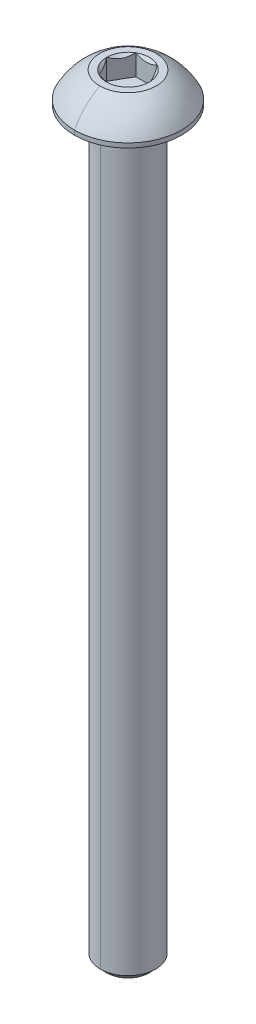
ISO-10303-21;
HEADER;
FILE_DESCRIPTION(('STEP AP214'),'2;1');
FILE_NAME('part.step','',(''),(''),'','','');
FILE_SCHEMA(('AUTOMOTIVE_DESIGN { 1 0 10303 214 1 1 1 1 }'));
ENDSEC;
DATA;
#1=APPLICATION_CONTEXT('core data for automotive mechanical design processes');
#2=APPLICATION_PROTOCOL_DEFINITION('international standard','automotive_design',2000,#1);
#3=PRODUCT_CONTEXT('',#1,'mechanical');
#4=PRODUCT('Part','Part','',(#3));
#5=PRODUCT_RELATED_PRODUCT_CATEGORY('part','',(#4));
#6=PRODUCT_DEFINITION_FORMATION('','',#4);
#7=PRODUCT_DEFINITION_CONTEXT('part definition',#1,'design');
#8=PRODUCT_DEFINITION('design','',#6,#7);
#9=PRODUCT_DEFINITION_SHAPE('','',#8);
#10=(LENGTH_UNIT() NAMED_UNIT(*) SI_UNIT(.MILLI.,.METRE.));
#11=(NAMED_UNIT(*) PLANE_ANGLE_UNIT() SI_UNIT($,.RADIAN.));
#12=(NAMED_UNIT(*) SI_UNIT($,.STERADIAN.) SOLID_ANGLE_UNIT());
#13=UNCERTAINTY_MEASURE_WITH_UNIT(LENGTH_MEASURE(1.E-05),#10,'distance_accuracy_value','');
#14=(GEOMETRIC_REPRESENTATION_CONTEXT(3) GLOBAL_UNCERTAINTY_ASSIGNED_CONTEXT((#13)) GLOBAL_UNIT_ASSIGNED_CONTEXT((#10,
#11,#12)) REPRESENTATION_CONTEXT('',''));
#15=CARTESIAN_POINT('',(0.,0.,0.));
#16=DIRECTION('',(0.,0.,1.));
#17=DIRECTION('',(1.,0.,0.));
#18=AXIS2_PLACEMENT_3D('',#15,#16,#17);
#19=CARTESIAN_POINT('',(0.,-0.152399999999997,0.));
#20=DIRECTION('',(0.,1.,0.));
#21=DIRECTION('',(0.,0.,1.));
#22=AXIS2_PLACEMENT_3D('',#19,#20,#21);
#23=TOROIDAL_SURFACE('',#22,2.5273,0.1524);
#24=CARTESIAN_POINT('',(0.,-0.152399999999997,-2.5273));
#25=DIRECTION('',(1.,0.,0.));
#26=DIRECTION('',(0.,0.,-1.));
#27=AXIS2_PLACEMENT_3D('',#24,#25,#26);
#28=CIRCLE('',#27,0.1524);
#29=CARTESIAN_POINT('',(0.,0.,-2.5273));
#30=VERTEX_POINT('',#29);
#31=CARTESIAN_POINT('',(0.,-0.152399999999997,-2.3749));
#32=VERTEX_POINT('',#31);
#33=EDGE_CURVE('E252',#30,#32,#28,.T.);
#34=ORIENTED_EDGE('',*,*,#33,.F.);
#35=CARTESIAN_POINT('',(0.,0.,0.));
#36=DIRECTION('',(0.,1.,0.));
#37=DIRECTION('',(0.,0.,1.));
#38=AXIS2_PLACEMENT_3D('',#35,#36,#37);
#39=CIRCLE('',#38,2.5273);
#40=CARTESIAN_POINT('',(0.,0.,2.5273));
#41=VERTEX_POINT('',#40);
#42=EDGE_CURVE('E259',#41,#30,#39,.T.);
#43=ORIENTED_EDGE('',*,*,#42,.F.);
#44=CARTESIAN_POINT('',(0.,-0.152399999999997,2.5273));
#45=DIRECTION('',(-1.,0.,0.));
#46=DIRECTION('',(0.,0.,1.));
#47=AXIS2_PLACEMENT_3D('',#44,#45,#46);
#48=CIRCLE('',#47,0.1524);
#49=CARTESIAN_POINT('',(0.,-0.152399999999997,2.3749));
#50=VERTEX_POINT('',#49);
#51=EDGE_CURVE('E290',#41,#50,#48,.T.);
#52=ORIENTED_EDGE('',*,*,#51,.T.);
#53=CARTESIAN_POINT('',(0.,-0.152399999999997,0.));
#54=DIRECTION('',(0.,-1.,0.));
#55=DIRECTION('',(0.,0.,1.));
#56=AXIS2_PLACEMENT_3D('',#53,#54,#55);
#57=CIRCLE('',#56,2.3749);
#58=EDGE_CURVE('E1186',#32,#50,#57,.T.);
#59=ORIENTED_EDGE('',*,*,#58,.F.);
#60=EDGE_LOOP('',(#34,#43,#52,#59));
#61=FACE_BOUND('',#60,.T.);
#62=ADVANCED_FACE('F16',(#61),#23,.F.);
#63=CARTESIAN_POINT('',(0.,2.5654,0.));
#64=DIRECTION('',(0.,1.,0.));
#65=DIRECTION('',(0.,0.,1.));
#66=AXIS2_PLACEMENT_3D('',#63,#64,#65);
#67=CONICAL_SURFACE('',#66,1.83308710467706,0.78539816339745);
#68=DIRECTION('',(0.,0.707106781186546,-0.707106781186549));
#69=VECTOR('',#68,1.);
#70=CARTESIAN_POINT('',(0.,2.5654,-1.83308710467706));
#71=LINE('',#70,#69);
#72=CARTESIAN_POINT('',(0.,0.732312895322944,0.));
#73=VERTEX_POINT('',#72);
#74=CARTESIAN_POINT('',(0.,0.7874,-0.0550871046770556));
#75=VERTEX_POINT('',#74);
#76=EDGE_CURVE('E119',#73,#75,#71,.T.);
#77=ORIENTED_EDGE('',*,*,#76,.F.);
#78=DIRECTION('',(0.,0.707106781186546,0.707106781186549));
#79=VECTOR('',#78,1.);
#80=CARTESIAN_POINT('',(0.,2.5654,1.83308710467706));
#81=LINE('',#80,#79);
#82=CARTESIAN_POINT('',(0.,0.7874,0.0550871046770556));
#83=VERTEX_POINT('',#82);
#84=EDGE_CURVE('E275',#73,#83,#81,.T.);
#85=ORIENTED_EDGE('',*,*,#84,.T.);
#86=CARTESIAN_POINT('',(0.,0.7874,0.));
#87=DIRECTION('',(0.,1.,0.));
#88=DIRECTION('',(0.,0.,1.));
#89=AXIS2_PLACEMENT_3D('',#86,#87,#88);
#90=CIRCLE('',#89,0.0550871046770558);
#91=EDGE_CURVE('E107',#83,#75,#90,.T.);
#92=ORIENTED_EDGE('',*,*,#91,.T.);
#93=EDGE_LOOP('',(#77,#85,#92));
#94=FACE_BOUND('',#93,.T.);
#95=ADVANCED_FACE('F315',(#94),#67,.F.);
#96=CARTESIAN_POINT('',(1.83308710467706,0.7874,0.));
#97=DIRECTION('',(0.866025403784439,0.,-0.5));
#98=DIRECTION('',(0.,-1.,0.));
#99=AXIS2_PLACEMENT_3D('',#96,#97,#98);
#100=PLANE('',#99);
#101=DIRECTION('',(0.,1.,0.));
#102=VECTOR('',#101,1.);
#103=CARTESIAN_POINT('',(1.83308710467706,0.7874,0.));
#104=LINE('',#103,#102);
#105=CARTESIAN_POINT('',(1.83308710467706,0.7874,0.));
#106=VERTEX_POINT('',#105);
#107=CARTESIAN_POINT('',(1.83308710467706,2.5654,0.));
#108=VERTEX_POINT('',#107);
#109=EDGE_CURVE('E11',#106,#108,#104,.T.);
#110=ORIENTED_EDGE('',*,*,#109,.T.);
#111=CARTESIAN_POINT('',(1.83308710467706,2.5654,0.));
#112=CARTESIAN_POINT('',(1.58854939316106,2.32086228848399,-0.423551740712339));
#113=CARTESIAN_POINT('',(1.37650342717985,2.31981648546325,-0.790826127331817));
#114=CARTESIAN_POINT('',(1.16317917435944,2.31876437797812,-1.16031457170343));
#115=CARTESIAN_POINT('',(0.91654355233853,2.5654,-1.5875));
#116=B_SPLINE_CURVE_WITH_KNOTS('',2,(#111,#112,#113,#114,#115),.UNSPECIFIED.,.F.,.F.,(3,2,3),
(0.,0.5,1.),.UNSPECIFIED.);
#117=CARTESIAN_POINT('',(0.916543552338531,2.5654,-1.5875));
#118=VERTEX_POINT('',#117);
#119=EDGE_CURVE('E264',#108,#118,#116,.T.);
#120=ORIENTED_EDGE('',*,*,#119,.T.);
#121=DIRECTION('',(0.,1.,0.));
#122=VECTOR('',#121,1.);
#123=CARTESIAN_POINT('',(0.916543552338531,0.7874,-1.5875));
#124=LINE('',#123,#122);
#125=CARTESIAN_POINT('',(0.916543552338531,0.7874,-1.5875));
#126=VERTEX_POINT('',#125);
#127=EDGE_CURVE('E168',#126,#118,#124,.T.);
#128=ORIENTED_EDGE('',*,*,#127,.F.);
#129=DIRECTION('',(-0.5,0.,-0.866025403784439));
#130=VECTOR('',#129,1.);
#131=CARTESIAN_POINT('',(1.83308710467706,0.7874,0.));
#132=LINE('',#131,#130);
#133=EDGE_CURVE('E246',#106,#126,#132,.T.);
#134=ORIENTED_EDGE('',*,*,#133,.F.);
#135=EDGE_LOOP('',(#110,#120,#128,#134));
#136=FACE_BOUND('',#135,.T.);
#137=ADVANCED_FACE('F304',(#136),#100,.F.);
#138=CARTESIAN_POINT('',(0.916543552338531,0.7874,1.5875));
#139=DIRECTION('',(0.866025403784439,0.,0.5));
#140=DIRECTION('',(0.,-1.,0.));
#141=AXIS2_PLACEMENT_3D('',#138,#139,#140);
#142=PLANE('',#141);
#143=DIRECTION('',(0.,1.,0.));
#144=VECTOR('',#143,1.);
#145=CARTESIAN_POINT('',(0.916543552338531,0.7874,1.5875));
#146=LINE('',#145,#144);
#147=CARTESIAN_POINT('',(0.916543552338531,0.7874,1.5875));
#148=VERTEX_POINT('',#147);
#149=CARTESIAN_POINT('',(0.916543552338531,2.5654,1.5875));
#150=VERTEX_POINT('',#149);
#151=EDGE_CURVE('E29',#148,#150,#146,.T.);
#152=ORIENTED_EDGE('',*,*,#151,.T.);
#153=CARTESIAN_POINT('',(0.916543552338531,2.5654,1.5875));
#154=CARTESIAN_POINT('',(1.16108126385472,2.32086228848382,1.16394825928734));
#155=CARTESIAN_POINT('',(1.37312722983574,2.31981648546325,0.796673872668184));
#156=CARTESIAN_POINT('',(1.58645148265633,2.3187643779783,0.427185428296259));
#157=CARTESIAN_POINT('',(1.83308710467706,2.5654,0.));
#158=B_SPLINE_CURVE_WITH_KNOTS('',2,(#153,#154,#155,#156,#157),.UNSPECIFIED.,.F.,.F.,(3,2,3),
(0.,0.5,1.),.UNSPECIFIED.);
#159=EDGE_CURVE('E428',#150,#108,#158,.T.);
#160=ORIENTED_EDGE('',*,*,#159,.T.);
#161=ORIENTED_EDGE('',*,*,#109,.F.);
#162=DIRECTION('',(0.5,0.,-0.866025403784439));
#163=VECTOR('',#162,1.);
#164=CARTESIAN_POINT('',(0.916543552338531,0.7874,1.5875));
#165=LINE('',#164,#163);
#166=EDGE_CURVE('E268',#148,#106,#165,.T.);
#167=ORIENTED_EDGE('',*,*,#166,.F.);
#168=EDGE_LOOP('',(#152,#160,#161,#167));
#169=FACE_BOUND('',#168,.T.);
#170=ADVANCED_FACE('F314',(#169),#142,.F.);
#171=CARTESIAN_POINT('',(-0.91654355233853,0.7874,1.5875));
#172=DIRECTION('',(0.,0.,1.));
#173=DIRECTION('',(1.,0.,0.));
#174=AXIS2_PLACEMENT_3D('',#171,#172,#173);
#175=PLANE('',#174);
#176=DIRECTION('',(0.,1.,0.));
#177=VECTOR('',#176,1.);
#178=CARTESIAN_POINT('',(-0.91654355233853,0.7874,1.5875));
#179=LINE('',#178,#177);
#180=CARTESIAN_POINT('',(-0.91654355233853,0.7874,1.5875));
#181=VERTEX_POINT('',#180);
#182=CARTESIAN_POINT('',(-0.91654355233853,2.5654,1.5875));
#183=VERTEX_POINT('',#182);
#184=EDGE_CURVE('E394',#181,#183,#179,.T.);
#185=ORIENTED_EDGE('',*,*,#184,.T.);
#186=CARTESIAN_POINT('',(-0.916543552338531,2.5654,1.5875));
#187=CARTESIAN_POINT('',(-0.684381010738564,2.44931872920002,1.5875));
#188=CARTESIAN_POINT('',(-0.4718738638875,2.38845938444161,1.5875));
#189=CARTESIAN_POINT('',(-0.232175759974894,2.31981289532294,1.5875));
#190=CARTESIAN_POINT('',(0.,2.31981289532294,1.5875));
#191=B_SPLINE_CURVE_WITH_KNOTS('',2,(#186,#187,#188,#189,#190),.UNSPECIFIED.,.F.,.F.,(3,2,3),
(0.,0.5,1.),.UNSPECIFIED.);
#192=CARTESIAN_POINT('',(0.,2.31981289532294,1.5875));
#193=VERTEX_POINT('',#192);
#194=EDGE_CURVE('E389',#183,#193,#191,.T.);
#195=ORIENTED_EDGE('',*,*,#194,.T.);
#196=CARTESIAN_POINT('',(0.,2.31981289532294,1.5875));
#197=CARTESIAN_POINT('',(0.229732695645398,2.31981289532294,1.5875));
#198=CARTESIAN_POINT('',(0.471961624215038,2.3884843914945,1.5875));
#199=CARTESIAN_POINT('',(0.68154594324368,2.44790119545257,1.5875));
#200=CARTESIAN_POINT('',(0.91654355233853,2.5654,1.5875));
#201=B_SPLINE_CURVE_WITH_KNOTS('',2,(#196,#197,#198,#199,#200),.UNSPECIFIED.,.F.,.F.,(3,2,3),
(0.,0.5,1.),.UNSPECIFIED.);
#202=EDGE_CURVE('E354',#193,#150,#201,.T.);
#203=ORIENTED_EDGE('',*,*,#202,.T.);
#204=ORIENTED_EDGE('',*,*,#151,.F.);
#205=DIRECTION('',(1.,0.,0.));
#206=VECTOR('',#205,1.);
#207=CARTESIAN_POINT('',(-0.91654355233853,0.7874,1.5875));
#208=LINE('',#207,#206);
#209=EDGE_CURVE('E271',#181,#148,#208,.T.);
#210=ORIENTED_EDGE('',*,*,#209,.F.);
#211=EDGE_LOOP('',(#185,#195,#203,#204,#210));
#212=FACE_BOUND('',#211,.T.);
#213=ADVANCED_FACE('F358',(#212),#175,.F.);
#214=CARTESIAN_POINT('',(-1.83308710467706,0.7874,0.));
#215=DIRECTION('',(-0.866025403784439,0.,0.5));
#216=DIRECTION('',(0.,1.,0.));
#217=AXIS2_PLACEMENT_3D('',#214,#215,#216);
#218=PLANE('',#217);
#219=DIRECTION('',(0.,1.,0.));
#220=VECTOR('',#219,1.);
#221=CARTESIAN_POINT('',(-1.83308710467706,0.7874,0.));
#222=LINE('',#221,#220);
#223=CARTESIAN_POINT('',(-1.83308710467706,0.7874,0.));
#224=VERTEX_POINT('',#223);
#225=CARTESIAN_POINT('',(-1.83308710467706,2.5654,0.));
#226=VERTEX_POINT('',#225);
#227=EDGE_CURVE('E186',#224,#226,#222,.T.);
#228=ORIENTED_EDGE('',*,*,#227,.T.);
#229=CARTESIAN_POINT('',(-1.83308710467706,2.5654,0.));
#230=CARTESIAN_POINT('',(-1.58854939316106,2.32086228848399,0.423551740712331));
#231=CARTESIAN_POINT('',(-1.37650342717985,2.31981648546325,0.790826127331817));
#232=CARTESIAN_POINT('',(-1.16317917435944,2.31876437797812,1.16031457170343));
#233=CARTESIAN_POINT('',(-0.91654355233853,2.5654,1.5875));
#234=B_SPLINE_CURVE_WITH_KNOTS('',2,(#229,#230,#231,#232,#233),.UNSPECIFIED.,.F.,.F.,(3,2,3),
(0.,0.5,1.),.UNSPECIFIED.);
#235=EDGE_CURVE('E466',#226,#183,#234,.T.);
#236=ORIENTED_EDGE('',*,*,#235,.T.);
#237=ORIENTED_EDGE('',*,*,#184,.F.);
#238=DIRECTION('',(0.5,0.,0.866025403784438));
#239=VECTOR('',#238,1.);
#240=CARTESIAN_POINT('',(-1.83308710467706,0.7874,0.));
#241=LINE('',#240,#239);
#242=EDGE_CURVE('E284',#224,#181,#241,.T.);
#243=ORIENTED_EDGE('',*,*,#242,.F.);
#244=EDGE_LOOP('',(#228,#236,#237,#243));
#245=FACE_BOUND('',#244,.T.);
#246=ADVANCED_FACE('F368',(#245),#218,.F.);
#247=CARTESIAN_POINT('',(-0.916543552338531,0.7874,-1.5875));
#248=DIRECTION('',(-0.866025403784439,0.,-0.5));
#249=DIRECTION('',(-0.5,0.,0.866025403784439));
#250=AXIS2_PLACEMENT_3D('',#247,#248,#249);
#251=PLANE('',#250);
#252=DIRECTION('',(0.,1.,0.));
#253=VECTOR('',#252,1.);
#254=CARTESIAN_POINT('',(-0.916543552338531,0.7874,-1.5875));
#255=LINE('',#254,#253);
#256=CARTESIAN_POINT('',(-0.916543552338531,0.7874,-1.5875));
#257=VERTEX_POINT('',#256);
#258=CARTESIAN_POINT('',(-0.916543552338531,2.5654,-1.5875));
#259=VERTEX_POINT('',#258);
#260=EDGE_CURVE('E511',#257,#259,#255,.T.);
#261=ORIENTED_EDGE('',*,*,#260,.T.);
#262=CARTESIAN_POINT('',(-0.916543552338531,2.5654,-1.5875));
#263=CARTESIAN_POINT('',(-1.16108126385453,2.320862288484,-1.16394825928767));
#264=CARTESIAN_POINT('',(-1.37312722983574,2.31981648546325,-0.796673872668183));
#265=CARTESIAN_POINT('',(-1.58645148265615,2.31876437797813,-0.427185428296571));
#266=CARTESIAN_POINT('',(-1.83308710467706,2.5654,0.));
#267=B_SPLINE_CURVE_WITH_KNOTS('',2,(#262,#263,#264,#265,#266),.UNSPECIFIED.,.F.,.F.,(3,2,3),
(0.,0.5,1.),.UNSPECIFIED.);
#268=EDGE_CURVE('E506',#259,#226,#267,.T.);
#269=ORIENTED_EDGE('',*,*,#268,.T.);
#270=ORIENTED_EDGE('',*,*,#227,.F.);
#271=DIRECTION('',(-0.5,0.,0.866025403784439));
#272=VECTOR('',#271,1.);
#273=CARTESIAN_POINT('',(-0.916543552338531,0.7874,-1.5875));
#274=LINE('',#273,#272);
#275=EDGE_CURVE('E245',#257,#224,#274,.T.);
#276=ORIENTED_EDGE('',*,*,#275,.F.);
#277=EDGE_LOOP('',(#261,#269,#270,#276));
#278=FACE_BOUND('',#277,.T.);
#279=ADVANCED_FACE('F451',(#278),#251,.F.);
#280=CARTESIAN_POINT('',(0.916543552338531,0.7874,-1.5875));
#281=DIRECTION('',(0.,0.,-1.));
#282=DIRECTION('',(-1.,0.,0.));
#283=AXIS2_PLACEMENT_3D('',#280,#281,#282);
#284=PLANE('',#283);
#285=ORIENTED_EDGE('',*,*,#127,.T.);
#286=CARTESIAN_POINT('',(0.916543552338531,2.5654,-1.5875));
#287=CARTESIAN_POINT('',(0.68330023814449,2.44877834290298,-1.5875));
#288=CARTESIAN_POINT('',(0.472022049766507,2.38850161206546,-1.5875));
#289=CARTESIAN_POINT('',(0.231606862063275,2.31991222444484,-1.5875));
#290=CARTESIAN_POINT('',(0.000126990617285933,2.31981290040219,-1.5875));
#291=CARTESIAN_POINT('',(-0.230319895797069,2.3197140195957,-1.5875));
#292=CARTESIAN_POINT('',(-0.471813597713689,2.38844221424328,-1.5875));
#293=CARTESIAN_POINT('',(-0.682613944360854,2.44843519601116,-1.5875));
#294=CARTESIAN_POINT('',(-0.916543552338529,2.5654,-1.5875));
#295=B_SPLINE_CURVE_WITH_KNOTS('',2,(#286,#287,#288,#289,#290,#291,#292,#293,#294),
.UNSPECIFIED.,.F.,.F.,(3,2,2,2,3),(0.,0.25,0.5,0.75,1.),.UNSPECIFIED.);
#296=EDGE_CURVE('E522',#118,#259,#295,.T.);
#297=ORIENTED_EDGE('',*,*,#296,.T.);
#298=ORIENTED_EDGE('',*,*,#260,.F.);
#299=DIRECTION('',(-1.,0.,0.));
#300=VECTOR('',#299,1.);
#301=CARTESIAN_POINT('',(0.916543552338531,0.7874,-1.5875));
#302=LINE('',#301,#300);
#303=EDGE_CURVE('E241',#126,#257,#302,.T.);
#304=ORIENTED_EDGE('',*,*,#303,.F.);
#305=EDGE_LOOP('',(#285,#297,#298,#304));
#306=FACE_BOUND('',#305,.T.);
#307=ADVANCED_FACE('F369',(#306),#284,.F.);
#308=CARTESIAN_POINT('',(0.,0.7874,0.));
#309=DIRECTION('',(0.,1.,0.));
#310=DIRECTION('',(1.,0.,0.));
#311=AXIS2_PLACEMENT_3D('',#308,#309,#310);
#312=PLANE('',#311);
#313=ORIENTED_EDGE('',*,*,#91,.F.);
#314=CARTESIAN_POINT('',(0.,0.7874,0.));
#315=DIRECTION('',(0.,1.,0.));
#316=DIRECTION('',(0.,0.,1.));
#317=AXIS2_PLACEMENT_3D('',#314,#315,#316);
#318=CIRCLE('',#317,0.0550871046770558);
#319=EDGE_CURVE('E274',#75,#83,#318,.T.);
#320=ORIENTED_EDGE('',*,*,#319,.F.);
#321=EDGE_LOOP('',(#313,#320));
#322=FACE_BOUND('',#321,.T.);
#323=ORIENTED_EDGE('',*,*,#133,.T.);
#324=ORIENTED_EDGE('',*,*,#303,.T.);
#325=ORIENTED_EDGE('',*,*,#275,.T.);
#326=ORIENTED_EDGE('',*,*,#242,.T.);
#327=ORIENTED_EDGE('',*,*,#209,.T.);
#328=ORIENTED_EDGE('',*,*,#166,.T.);
#329=EDGE_LOOP('',(#323,#324,#325,#326,#327,#328));
#330=FACE_BOUND('',#329,.T.);
#331=ADVANCED_FACE('F576',(#322,#330),#312,.T.);
#332=CARTESIAN_POINT('',(0.,2.5654,0.));
#333=DIRECTION('',(0.,1.,0.));
#334=DIRECTION('',(0.,0.,1.));
#335=AXIS2_PLACEMENT_3D('',#332,#333,#334);
#336=CONICAL_SURFACE('',#335,1.83308710467706,0.78539816339745);
#337=CARTESIAN_POINT('',(0.,2.5654,0.));
#338=DIRECTION('',(0.,1.,0.));
#339=DIRECTION('',(0.,0.,1.));
#340=AXIS2_PLACEMENT_3D('',#337,#338,#339);
#341=CIRCLE('',#340,1.83308710467706);
#342=EDGE_CURVE('E546',#108,#118,#341,.T.);
#343=ORIENTED_EDGE('',*,*,#342,.T.);
#344=ORIENTED_EDGE('',*,*,#119,.F.);
#345=EDGE_LOOP('',(#343,#344));
#346=FACE_BOUND('',#345,.T.);
#347=ADVANCED_FACE('F444',(#346),#336,.F.);
#348=CARTESIAN_POINT('',(0.,2.5654,0.));
#349=DIRECTION('',(0.,1.,0.));
#350=DIRECTION('',(0.,0.,1.));
#351=AXIS2_PLACEMENT_3D('',#348,#349,#350);
#352=CONICAL_SURFACE('',#351,1.83308710467706,0.78539816339745);
#353=CARTESIAN_POINT('',(0.,2.5654,0.));
#354=DIRECTION('',(0.,1.,0.));
#355=DIRECTION('',(0.,0.,1.));
#356=AXIS2_PLACEMENT_3D('',#353,#354,#355);
#357=CIRCLE('',#356,1.83308710467706);
#358=EDGE_CURVE('E551',#150,#108,#357,.T.);
#359=ORIENTED_EDGE('',*,*,#358,.T.);
#360=ORIENTED_EDGE('',*,*,#159,.F.);
#361=EDGE_LOOP('',(#359,#360));
#362=FACE_BOUND('',#361,.T.);
#363=ADVANCED_FACE('F407',(#362),#352,.F.);
#364=CARTESIAN_POINT('',(0.,2.5654,0.));
#365=DIRECTION('',(0.,1.,0.));
#366=DIRECTION('',(0.,0.,1.));
#367=AXIS2_PLACEMENT_3D('',#364,#365,#366);
#368=CONICAL_SURFACE('',#367,1.83308710467706,0.78539816339745);
#369=DIRECTION('',(0.,0.707106781186546,0.707106781186549));
#370=VECTOR('',#369,1.);
#371=CARTESIAN_POINT('',(0.,2.5654,1.83308710467706));
#372=LINE('',#371,#370);
#373=CARTESIAN_POINT('',(0.,2.5654,1.83308710467706));
#374=VERTEX_POINT('',#373);
#375=EDGE_CURVE('E586',#193,#374,#372,.T.);
#376=ORIENTED_EDGE('',*,*,#375,.F.);
#377=ORIENTED_EDGE('',*,*,#194,.F.);
#378=CARTESIAN_POINT('',(0.,2.5654,0.));
#379=DIRECTION('',(0.,1.,0.));
#380=DIRECTION('',(0.,0.,1.));
#381=AXIS2_PLACEMENT_3D('',#378,#379,#380);
#382=CIRCLE('',#381,1.83308710467706);
#383=EDGE_CURVE('E565',#183,#374,#382,.T.);
#384=ORIENTED_EDGE('',*,*,#383,.T.);
#385=EDGE_LOOP('',(#376,#377,#384));
#386=FACE_BOUND('',#385,.T.);
#387=ADVANCED_FACE('F396',(#386),#368,.F.);
#388=CARTESIAN_POINT('',(0.,2.5654,0.));
#389=DIRECTION('',(0.,1.,0.));
#390=DIRECTION('',(0.,0.,1.));
#391=AXIS2_PLACEMENT_3D('',#388,#389,#390);
#392=CONICAL_SURFACE('',#391,1.83308710467706,0.78539816339745);
#393=CARTESIAN_POINT('',(0.,2.5654,0.));
#394=DIRECTION('',(0.,1.,0.));
#395=DIRECTION('',(0.,0.,1.));
#396=AXIS2_PLACEMENT_3D('',#393,#394,#395);
#397=CIRCLE('',#396,1.83308710467706);
#398=EDGE_CURVE('E542',#226,#183,#397,.T.);
#399=ORIENTED_EDGE('',*,*,#398,.T.);
#400=ORIENTED_EDGE('',*,*,#235,.F.);
#401=EDGE_LOOP('',(#399,#400));
#402=FACE_BOUND('',#401,.T.);
#403=ADVANCED_FACE('F406',(#402),#392,.F.);
#404=CARTESIAN_POINT('',(0.,2.5654,0.));
#405=DIRECTION('',(0.,1.,0.));
#406=DIRECTION('',(0.,0.,1.));
#407=AXIS2_PLACEMENT_3D('',#404,#405,#406);
#408=CONICAL_SURFACE('',#407,1.83308710467706,0.78539816339745);
#409=CARTESIAN_POINT('',(0.,2.5654,0.));
#410=DIRECTION('',(0.,1.,0.));
#411=DIRECTION('',(0.,0.,1.));
#412=AXIS2_PLACEMENT_3D('',#409,#410,#411);
#413=CIRCLE('',#412,1.83308710467706);
#414=EDGE_CURVE('E535',#259,#226,#413,.T.);
#415=ORIENTED_EDGE('',*,*,#414,.T.);
#416=ORIENTED_EDGE('',*,*,#268,.F.);
#417=EDGE_LOOP('',(#415,#416));
#418=FACE_BOUND('',#417,.T.);
#419=ADVANCED_FACE('F337',(#418),#408,.F.);
#420=CARTESIAN_POINT('',(0.,2.5654,0.));
#421=DIRECTION('',(0.,1.,0.));
#422=DIRECTION('',(0.,0.,1.));
#423=AXIS2_PLACEMENT_3D('',#420,#421,#422);
#424=CONICAL_SURFACE('',#423,1.83308710467706,0.78539816339745);
#425=CARTESIAN_POINT('',(0.,2.5654,0.));
#426=DIRECTION('',(0.,1.,0.));
#427=DIRECTION('',(0.,0.,1.));
#428=AXIS2_PLACEMENT_3D('',#425,#426,#427);
#429=CIRCLE('',#428,1.83308710467706);
#430=EDGE_CURVE('E279',#118,#259,#429,.T.);
#431=ORIENTED_EDGE('',*,*,#430,.T.);
#432=ORIENTED_EDGE('',*,*,#296,.F.);
#433=EDGE_LOOP('',(#431,#432));
#434=FACE_BOUND('',#433,.T.);
#435=ADVANCED_FACE('F333',(#434),#424,.F.);
#436=CARTESIAN_POINT('',(0.,2.5654,-2.413));
#437=DIRECTION('',(0.,-1.,0.));
#438=DIRECTION('',(0.,0.,-1.));
#439=AXIS2_PLACEMENT_3D('',#436,#437,#438);
#440=PLANE('',#439);
#441=ORIENTED_EDGE('',*,*,#430,.F.);
#442=ORIENTED_EDGE('',*,*,#342,.F.);
#443=ORIENTED_EDGE('',*,*,#358,.F.);
#444=CARTESIAN_POINT('',(0.,2.5654,0.));
#445=DIRECTION('',(0.,1.,0.));
#446=DIRECTION('',(0.,0.,1.));
#447=AXIS2_PLACEMENT_3D('',#444,#445,#446);
#448=CIRCLE('',#447,1.83308710467706);
#449=EDGE_CURVE('E584',#374,#150,#448,.T.);
#450=ORIENTED_EDGE('',*,*,#449,.F.);
#451=ORIENTED_EDGE('',*,*,#383,.F.);
#452=ORIENTED_EDGE('',*,*,#398,.F.);
#453=ORIENTED_EDGE('',*,*,#414,.F.);
#454=EDGE_LOOP('',(#441,#442,#443,#450,#451,#452,#453));
#455=FACE_BOUND('',#454,.T.);
#456=CARTESIAN_POINT('',(0.,2.5654,0.));
#457=DIRECTION('',(0.,1.,0.));
#458=DIRECTION('',(0.,0.,1.));
#459=AXIS2_PLACEMENT_3D('',#456,#457,#458);
#460=CIRCLE('',#459,2.413);
#461=CARTESIAN_POINT('',(0.,2.5654,2.413));
#462=VERTEX_POINT('',#461);
#463=CARTESIAN_POINT('',(0.,2.5654,-2.413));
#464=VERTEX_POINT('',#463);
#465=EDGE_CURVE('E234',#462,#464,#460,.T.);
#466=ORIENTED_EDGE('',*,*,#465,.T.);
#467=CARTESIAN_POINT('',(0.,2.5654,0.));
#468=DIRECTION('',(0.,1.,0.));
#469=DIRECTION('',(0.,0.,1.));
#470=AXIS2_PLACEMENT_3D('',#467,#468,#469);
#471=CIRCLE('',#470,2.413);
#472=EDGE_CURVE('E276',#464,#462,#471,.T.);
#473=ORIENTED_EDGE('',*,*,#472,.T.);
#474=EDGE_LOOP('',(#466,#473));
#475=FACE_BOUND('',#474,.T.);
#476=ADVANCED_FACE('F316',(#455,#475),#440,.F.);
#477=CARTESIAN_POINT('',(0.,-1.9398474797777,0.));
#478=DIRECTION('',(0.,1.,0.));
#479=DIRECTION('',(0.,0.,1.));
#480=AXIS2_PLACEMENT_3D('',#477,#478,#479);
#481=DEGENERATE_TOROIDAL_SURFACE('',#480,0.065843178235288,5.08,.T.);
#482=CARTESIAN_POINT('',(0.,-1.9398474797777,-0.065843178235288));
#483=DIRECTION('',(1.,0.,0.));
#484=DIRECTION('',(0.,0.,-1.));
#485=AXIS2_PLACEMENT_3D('',#482,#483,#484);
#486=CIRCLE('',#485,5.08);
#487=CARTESIAN_POINT('',(0.,0.381,-4.5847));
#488=VERTEX_POINT('',#487);
#489=EDGE_CURVE('E247',#488,#464,#486,.T.);
#490=ORIENTED_EDGE('',*,*,#489,.F.);
#491=CARTESIAN_POINT('',(0.,0.381,0.));
#492=DIRECTION('',(0.,1.,0.));
#493=DIRECTION('',(0.,0.,1.));
#494=AXIS2_PLACEMENT_3D('',#491,#492,#493);
#495=CIRCLE('',#494,4.5847);
#496=CARTESIAN_POINT('',(0.,0.381,4.5847));
#497=VERTEX_POINT('',#496);
#498=EDGE_CURVE('E280',#488,#497,#495,.T.);
#499=ORIENTED_EDGE('',*,*,#498,.T.);
#500=CARTESIAN_POINT('',(0.,-1.9398474797777,0.065843178235288));
#501=DIRECTION('',(-1.,0.,0.));
#502=DIRECTION('',(0.,0.,1.));
#503=AXIS2_PLACEMENT_3D('',#500,#501,#502);
#504=CIRCLE('',#503,5.08);
#505=EDGE_CURVE('E229',#497,#462,#504,.T.);
#506=ORIENTED_EDGE('',*,*,#505,.T.);
#507=ORIENTED_EDGE('',*,*,#472,.F.);
#508=EDGE_LOOP('',(#490,#499,#506,#507));
#509=FACE_BOUND('',#508,.T.);
#510=ADVANCED_FACE('F18',(#509),#481,.T.);
#511=CARTESIAN_POINT('',(0.,2.5654,0.));
#512=DIRECTION('',(0.,1.,0.));
#513=DIRECTION('',(0.,0.,1.));
#514=AXIS2_PLACEMENT_3D('',#511,#512,#513);
#515=CYLINDRICAL_SURFACE('',#514,4.5847);
#516=DIRECTION('',(0.,1.,0.));
#517=VECTOR('',#516,1.);
#518=CARTESIAN_POINT('',(0.,2.5654,-4.5847));
#519=LINE('',#518,#517);
#520=CARTESIAN_POINT('',(0.,0.,-4.5847));
#521=VERTEX_POINT('',#520);
#522=EDGE_CURVE('E225',#521,#488,#519,.T.);
#523=ORIENTED_EDGE('',*,*,#522,.F.);
#524=CARTESIAN_POINT('',(0.,0.,0.));
#525=DIRECTION('',(0.,1.,0.));
#526=DIRECTION('',(0.,0.,1.));
#527=AXIS2_PLACEMENT_3D('',#524,#525,#526);
#528=CIRCLE('',#527,4.5847);
#529=CARTESIAN_POINT('',(0.,0.,4.5847));
#530=VERTEX_POINT('',#529);
#531=EDGE_CURVE('E202',#521,#530,#528,.T.);
#532=ORIENTED_EDGE('',*,*,#531,.T.);
#533=DIRECTION('',(0.,1.,0.));
#534=VECTOR('',#533,1.);
#535=CARTESIAN_POINT('',(0.,2.5654,4.5847));
#536=LINE('',#535,#534);
#537=EDGE_CURVE('E218',#530,#497,#536,.T.);
#538=ORIENTED_EDGE('',*,*,#537,.T.);
#539=ORIENTED_EDGE('',*,*,#498,.F.);
#540=EDGE_LOOP('',(#523,#532,#538,#539));
#541=FACE_BOUND('',#540,.T.);
#542=ADVANCED_FACE('F322',(#541),#515,.T.);
#543=CARTESIAN_POINT('',(0.,0.,0.));
#544=DIRECTION('',(0.,1.,0.));
#545=DIRECTION('',(1.,0.,0.));
#546=AXIS2_PLACEMENT_3D('',#543,#544,#545);
#547=PLANE('',#546);
#548=ORIENTED_EDGE('',*,*,#42,.T.);
#549=CARTESIAN_POINT('',(0.,0.,0.));
#550=DIRECTION('',(0.,1.,0.));
#551=DIRECTION('',(0.,0.,1.));
#552=AXIS2_PLACEMENT_3D('',#549,#550,#551);
#553=CIRCLE('',#552,2.5273);
#554=EDGE_CURVE('E257',#30,#41,#553,.T.);
#555=ORIENTED_EDGE('',*,*,#554,.T.);
#556=EDGE_LOOP('',(#548,#555));
#557=FACE_BOUND('',#556,.T.);
#558=CARTESIAN_POINT('',(0.,0.,0.));
#559=DIRECTION('',(0.,1.,0.));
#560=DIRECTION('',(0.,0.,1.));
#561=AXIS2_PLACEMENT_3D('',#558,#559,#560);
#562=CIRCLE('',#561,4.5847);
#563=EDGE_CURVE('E233',#530,#521,#562,.T.);
#564=ORIENTED_EDGE('',*,*,#563,.F.);
#565=ORIENTED_EDGE('',*,*,#531,.F.);
#566=EDGE_LOOP('',(#564,#565));
#567=FACE_BOUND('',#566,.T.);
#568=ADVANCED_FACE('F325',(#557,#567),#547,.F.);
#569=CARTESIAN_POINT('',(0.,-62.9158,0.));
#570=DIRECTION('',(0.,1.,0.));
#571=DIRECTION('',(0.,0.,1.));
#572=AXIS2_PLACEMENT_3D('',#569,#570,#571);
#573=CONICAL_SURFACE('',#572,2.3749,0.785398163397443);
#574=DIRECTION('',(0.,0.707106781186551,-0.707106781186544));
#575=VECTOR('',#574,1.);
#576=CARTESIAN_POINT('',(0.,-62.9158,-2.3749));
#577=LINE('',#576,#575);
#578=CARTESIAN_POINT('',(0.,-63.5,-1.7907));
#579=VERTEX_POINT('',#578);
#580=CARTESIAN_POINT('',(0.,-62.9158,-2.3749));
#581=VERTEX_POINT('',#580);
#582=EDGE_CURVE('E207',#579,#581,#577,.T.);
#583=ORIENTED_EDGE('',*,*,#582,.F.);
#584=CARTESIAN_POINT('',(0.,-63.5,0.));
#585=DIRECTION('',(0.,-1.,0.));
#586=DIRECTION('',(0.,0.,1.));
#587=AXIS2_PLACEMENT_3D('',#584,#585,#586);
#588=CIRCLE('',#587,1.7907);
#589=CARTESIAN_POINT('',(0.,-63.5,1.7907));
#590=VERTEX_POINT('',#589);
#591=EDGE_CURVE('E193',#590,#579,#588,.T.);
#592=ORIENTED_EDGE('',*,*,#591,.F.);
#593=DIRECTION('',(0.,0.707106781186551,0.707106781186544));
#594=VECTOR('',#593,1.);
#595=CARTESIAN_POINT('',(0.,-62.9158,2.3749));
#596=LINE('',#595,#594);
#597=CARTESIAN_POINT('',(0.,-62.9158,2.3749));
#598=VERTEX_POINT('',#597);
#599=EDGE_CURVE('E216',#590,#598,#596,.T.);
#600=ORIENTED_EDGE('',*,*,#599,.T.);
#601=CARTESIAN_POINT('',(0.,-62.9158,0.));
#602=DIRECTION('',(0.,1.,0.));
#603=DIRECTION('',(0.,0.,1.));
#604=AXIS2_PLACEMENT_3D('',#601,#602,#603);
#605=CIRCLE('',#604,2.3749);
#606=EDGE_CURVE('E203',#581,#598,#605,.T.);
#607=ORIENTED_EDGE('',*,*,#606,.F.);
#608=EDGE_LOOP('',(#583,#592,#600,#607));
#609=FACE_BOUND('',#608,.T.);
#610=ADVANCED_FACE('F208',(#609),#573,.T.);
#611=CARTESIAN_POINT('',(0.,-63.5,0.));
#612=DIRECTION('',(0.,1.,0.));
#613=DIRECTION('',(1.,0.,0.));
#614=AXIS2_PLACEMENT_3D('',#611,#612,#613);
#615=PLANE('',#614);
#616=ORIENTED_EDGE('',*,*,#591,.T.);
#617=CARTESIAN_POINT('',(0.,-63.5,0.));
#618=DIRECTION('',(0.,-1.,0.));
#619=DIRECTION('',(0.,0.,1.));
#620=AXIS2_PLACEMENT_3D('',#617,#618,#619);
#621=CIRCLE('',#620,1.7907);
#622=EDGE_CURVE('E197',#579,#590,#621,.T.);
#623=ORIENTED_EDGE('',*,*,#622,.T.);
#624=EDGE_LOOP('',(#616,#623));
#625=FACE_BOUND('',#624,.T.);
#626=ADVANCED_FACE('F195',(#625),#615,.F.);
#627=CARTESIAN_POINT('',(0.,-63.5,0.));
#628=DIRECTION('',(0.,1.,0.));
#629=DIRECTION('',(0.,0.,1.));
#630=AXIS2_PLACEMENT_3D('',#627,#628,#629);
#631=CYLINDRICAL_SURFACE('',#630,2.3749);
#632=DIRECTION('',(0.,1.,0.));
#633=VECTOR('',#632,1.);
#634=CARTESIAN_POINT('',(0.,-63.5,-2.3749));
#635=LINE('',#634,#633);
#636=EDGE_CURVE('E1181',#581,#32,#635,.T.);
#637=ORIENTED_EDGE('',*,*,#636,.F.);
#638=ORIENTED_EDGE('',*,*,#606,.T.);
#639=DIRECTION('',(0.,1.,0.));
#640=VECTOR('',#639,1.);
#641=CARTESIAN_POINT('',(0.,-63.5,2.3749));
#642=LINE('',#641,#640);
#643=EDGE_CURVE('E240',#598,#50,#642,.T.);
#644=ORIENTED_EDGE('',*,*,#643,.T.);
#645=CARTESIAN_POINT('',(0.,-0.152399999999997,0.));
#646=DIRECTION('',(0.,-1.,0.));
#647=DIRECTION('',(0.,0.,1.));
#648=AXIS2_PLACEMENT_3D('',#645,#646,#647);
#649=CIRCLE('',#648,2.3749);
#650=EDGE_CURVE('E256',#50,#32,#649,.T.);
#651=ORIENTED_EDGE('',*,*,#650,.T.);
#652=EDGE_LOOP('',(#637,#638,#644,#651));
#653=FACE_BOUND('',#652,.T.);
#654=ADVANCED_FACE('F329',(#653),#631,.T.);
#655=CARTESIAN_POINT('',(0.,-63.5,0.));
#656=DIRECTION('',(0.,1.,0.));
#657=DIRECTION('',(0.,0.,1.));
#658=AXIS2_PLACEMENT_3D('',#655,#656,#657);
#659=CYLINDRICAL_SURFACE('',#658,2.3749);
#660=CARTESIAN_POINT('',(0.,-62.9158,0.));
#661=DIRECTION('',(0.,1.,0.));
#662=DIRECTION('',(0.,0.,1.));
#663=AXIS2_PLACEMENT_3D('',#660,#661,#662);
#664=CIRCLE('',#663,2.3749);
#665=EDGE_CURVE('E213',#598,#581,#664,.T.);
#666=ORIENTED_EDGE('',*,*,#665,.T.);
#667=ORIENTED_EDGE('',*,*,#636,.T.);
#668=ORIENTED_EDGE('',*,*,#58,.T.);
#669=ORIENTED_EDGE('',*,*,#643,.F.);
#670=EDGE_LOOP('',(#666,#667,#668,#669));
#671=FACE_BOUND('',#670,.T.);
#672=ADVANCED_FACE('F321',(#671),#659,.T.);
#673=CARTESIAN_POINT('',(0.,-62.9158,0.));
#674=DIRECTION('',(0.,1.,0.));
#675=DIRECTION('',(0.,0.,1.));
#676=AXIS2_PLACEMENT_3D('',#673,#674,#675);
#677=CONICAL_SURFACE('',#676,2.3749,0.785398163397443);
#678=ORIENTED_EDGE('',*,*,#622,.F.);
#679=ORIENTED_EDGE('',*,*,#582,.T.);
#680=ORIENTED_EDGE('',*,*,#665,.F.);
#681=ORIENTED_EDGE('',*,*,#599,.F.);
#682=EDGE_LOOP('',(#678,#679,#680,#681));
#683=FACE_BOUND('',#682,.T.);
#684=ADVANCED_FACE('F215',(#683),#677,.T.);
#685=CARTESIAN_POINT('',(0.,2.5654,0.));
#686=DIRECTION('',(0.,1.,0.));
#687=DIRECTION('',(0.,0.,1.));
#688=AXIS2_PLACEMENT_3D('',#685,#686,#687);
#689=CYLINDRICAL_SURFACE('',#688,4.5847);
#690=ORIENTED_EDGE('',*,*,#563,.T.);
#691=ORIENTED_EDGE('',*,*,#522,.T.);
#692=CARTESIAN_POINT('',(0.,0.381,0.));
#693=DIRECTION('',(0.,1.,0.));
#694=DIRECTION('',(0.,0.,1.));
#695=AXIS2_PLACEMENT_3D('',#692,#693,#694);
#696=CIRCLE('',#695,4.5847);
#697=EDGE_CURVE('E251',#497,#488,#696,.T.);
#698=ORIENTED_EDGE('',*,*,#697,.F.);
#699=ORIENTED_EDGE('',*,*,#537,.F.);
#700=EDGE_LOOP('',(#690,#691,#698,#699));
#701=FACE_BOUND('',#700,.T.);
#702=ADVANCED_FACE('F320',(#701),#689,.T.);
#703=CARTESIAN_POINT('',(0.,-1.9398474797777,0.));
#704=DIRECTION('',(0.,1.,0.));
#705=DIRECTION('',(0.,0.,1.));
#706=AXIS2_PLACEMENT_3D('',#703,#704,#705);
#707=DEGENERATE_TOROIDAL_SURFACE('',#706,0.065843178235288,5.08,.T.);
#708=ORIENTED_EDGE('',*,*,#697,.T.);
#709=ORIENTED_EDGE('',*,*,#489,.T.);
#710=ORIENTED_EDGE('',*,*,#465,.F.);
#711=ORIENTED_EDGE('',*,*,#505,.F.);
#712=EDGE_LOOP('',(#708,#709,#710,#711));
#713=FACE_BOUND('',#712,.T.);
#714=ADVANCED_FACE('F371',(#713),#707,.T.);
#715=CARTESIAN_POINT('',(0.,2.5654,0.));
#716=DIRECTION('',(0.,1.,0.));
#717=DIRECTION('',(0.,0.,1.));
#718=AXIS2_PLACEMENT_3D('',#715,#716,#717);
#719=CONICAL_SURFACE('',#718,1.83308710467706,0.78539816339745);
#720=ORIENTED_EDGE('',*,*,#202,.F.);
#721=ORIENTED_EDGE('',*,*,#375,.T.);
#722=ORIENTED_EDGE('',*,*,#449,.T.);
#723=EDGE_LOOP('',(#720,#721,#722));
#724=FACE_BOUND('',#723,.T.);
#725=ADVANCED_FACE('F483',(#724),#719,.F.);
#726=CARTESIAN_POINT('',(0.,2.5654,0.));
#727=DIRECTION('',(0.,1.,0.));
#728=DIRECTION('',(0.,0.,1.));
#729=AXIS2_PLACEMENT_3D('',#726,#727,#728);
#730=CONICAL_SURFACE('',#729,1.83308710467706,0.78539816339745);
#731=ORIENTED_EDGE('',*,*,#84,.F.);
#732=ORIENTED_EDGE('',*,*,#76,.T.);
#733=ORIENTED_EDGE('',*,*,#319,.T.);
#734=EDGE_LOOP('',(#731,#732,#733));
#735=FACE_BOUND('',#734,.T.);
#736=ADVANCED_FACE('F412',(#735),#730,.F.);
#737=CARTESIAN_POINT('',(0.,-0.152399999999997,0.));
#738=DIRECTION('',(0.,1.,0.));
#739=DIRECTION('',(0.,0.,1.));
#740=AXIS2_PLACEMENT_3D('',#737,#738,#739);
#741=TOROIDAL_SURFACE('',#740,2.5273,0.1524);
#742=ORIENTED_EDGE('',*,*,#554,.F.);
#743=ORIENTED_EDGE('',*,*,#33,.T.);
#744=ORIENTED_EDGE('',*,*,#650,.F.);
#745=ORIENTED_EDGE('',*,*,#51,.F.);
#746=EDGE_LOOP('',(#742,#743,#744,#745));
#747=FACE_BOUND('',#746,.T.);
#748=ADVANCED_FACE('F339',(#747),#741,.F.);
#749=CLOSED_SHELL('',(#62,#95,#137,#170,#213,#246,#279,#307,#331,#347,#363,#387,#403,#419,#435,
#476,#510,#542,#568,#610,#626,#654,#672,#684,#702,#714,#725,#736,#748));
#750=MANIFOLD_SOLID_BREP('B1',#749);
#751=ADVANCED_BREP_SHAPE_REPRESENTATION('',(#18,#750),#14);
#752=SHAPE_DEFINITION_REPRESENTATION(#9,#751);
ENDSEC;
END-ISO-10303-21;
